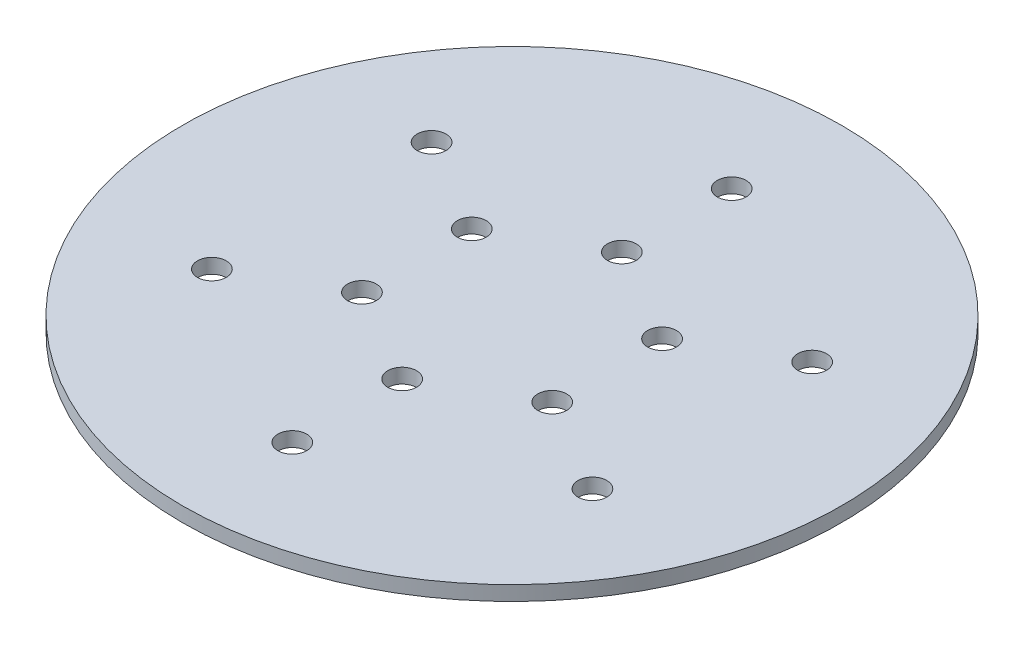
ISO-10303-21;
HEADER;
FILE_DESCRIPTION(('STEP AP214'),'2;1');
FILE_NAME('part.step','',(''),(''),'','','');
FILE_SCHEMA(('AUTOMOTIVE_DESIGN { 1 0 10303 214 1 1 1 1 }'));
ENDSEC;
DATA;
#1=APPLICATION_CONTEXT('core data for automotive mechanical design processes');
#2=APPLICATION_PROTOCOL_DEFINITION('international standard','automotive_design',2000,#1);
#3=PRODUCT_CONTEXT('',#1,'mechanical');
#4=PRODUCT('Part','Part','',(#3));
#5=PRODUCT_RELATED_PRODUCT_CATEGORY('part','',(#4));
#6=PRODUCT_DEFINITION_FORMATION('','',#4);
#7=PRODUCT_DEFINITION_CONTEXT('part definition',#1,'design');
#8=PRODUCT_DEFINITION('design','',#6,#7);
#9=PRODUCT_DEFINITION_SHAPE('','',#8);
#10=(LENGTH_UNIT() NAMED_UNIT(*) SI_UNIT(.MILLI.,.METRE.));
#11=(NAMED_UNIT(*) PLANE_ANGLE_UNIT() SI_UNIT($,.RADIAN.));
#12=(NAMED_UNIT(*) SI_UNIT($,.STERADIAN.) SOLID_ANGLE_UNIT());
#13=UNCERTAINTY_MEASURE_WITH_UNIT(LENGTH_MEASURE(1.E-05),#10,'distance_accuracy_value','');
#14=(GEOMETRIC_REPRESENTATION_CONTEXT(3) GLOBAL_UNCERTAINTY_ASSIGNED_CONTEXT((#13)) GLOBAL_UNIT_ASSIGNED_CONTEXT((#10,
#11,#12)) REPRESENTATION_CONTEXT('',''));
#15=CARTESIAN_POINT('',(0.,0.,0.));
#16=DIRECTION('',(0.,0.,1.));
#17=DIRECTION('',(1.,0.,0.));
#18=AXIS2_PLACEMENT_3D('',#15,#16,#17);
#19=CARTESIAN_POINT('',(0.,5.08,0.));
#20=DIRECTION('',(0.,1.,0.));
#21=DIRECTION('',(0.,0.,1.));
#22=AXIS2_PLACEMENT_3D('',#19,#20,#21);
#23=PLANE('',#22);
#24=CARTESIAN_POINT('',(-32.9955678841852,5.08,-19.0499999999967));
#25=DIRECTION('',(0.,1.,0.));
#26=DIRECTION('',(0.,0.,1.));
#27=AXIS2_PLACEMENT_3D('',#24,#25,#26);
#28=CIRCLE('',#27,5.);
#29=CARTESIAN_POINT('',(-32.9955678841852,5.08,-14.0499999999967));
#30=VERTEX_POINT('',#29);
#31=EDGE_CURVE('E101',#30,#30,#28,.T.);
#32=ORIENTED_EDGE('',*,*,#31,.F.);
#33=EDGE_LOOP('',(#32));
#34=FACE_BOUND('',#33,.T.);
#35=CARTESIAN_POINT('',(-32.9955678841814,5.08,19.0500000000033));
#36=DIRECTION('',(0.,1.,0.));
#37=DIRECTION('',(0.,0.,1.));
#38=AXIS2_PLACEMENT_3D('',#35,#36,#37);
#39=CIRCLE('',#38,5.);
#40=CARTESIAN_POINT('',(-32.9955678841814,5.08,24.0500000000033));
#41=VERTEX_POINT('',#40);
#42=EDGE_CURVE('E89',#41,#41,#39,.T.);
#43=ORIENTED_EDGE('',*,*,#42,.F.);
#44=EDGE_LOOP('',(#43));
#45=FACE_BOUND('',#44,.T.);
#46=CARTESIAN_POINT('',(7.57073809647924E-12,5.08,38.1));
#47=DIRECTION('',(0.,1.,0.));
#48=DIRECTION('',(0.,0.,1.));
#49=AXIS2_PLACEMENT_3D('',#46,#47,#48);
#50=CIRCLE('',#49,5.);
#51=CARTESIAN_POINT('',(7.57073809647924E-12,5.08,43.1));
#52=VERTEX_POINT('',#51);
#53=EDGE_CURVE('E77',#52,#52,#50,.T.);
#54=ORIENTED_EDGE('',*,*,#53,.F.);
#55=EDGE_LOOP('',(#54));
#56=FACE_BOUND('',#55,.T.);
#57=CARTESIAN_POINT('',(32.9955678841928,5.08,19.0499999999967));
#58=DIRECTION('',(0.,1.,0.));
#59=DIRECTION('',(0.,0.,1.));
#60=AXIS2_PLACEMENT_3D('',#57,#58,#59);
#61=CIRCLE('',#60,5.);
#62=CARTESIAN_POINT('',(32.9955678841928,5.08,24.0499999999967));
#63=VERTEX_POINT('',#62);
#64=EDGE_CURVE('E65',#63,#63,#61,.T.);
#65=ORIENTED_EDGE('',*,*,#64,.F.);
#66=EDGE_LOOP('',(#65));
#67=FACE_BOUND('',#66,.T.);
#68=CARTESIAN_POINT('',(32.995567884189,5.08,-19.0500000000033));
#69=DIRECTION('',(0.,1.,0.));
#70=DIRECTION('',(0.,0.,1.));
#71=AXIS2_PLACEMENT_3D('',#68,#69,#70);
#72=CIRCLE('',#71,5.);
#73=CARTESIAN_POINT('',(32.995567884189,5.08,-14.0500000000033));
#74=VERTEX_POINT('',#73);
#75=EDGE_CURVE('E53',#74,#74,#72,.T.);
#76=ORIENTED_EDGE('',*,*,#75,.F.);
#77=EDGE_LOOP('',(#76));
#78=FACE_BOUND('',#77,.T.);
#79=CARTESIAN_POINT('',(0.,5.08,-38.1));
#80=DIRECTION('',(0.,1.,0.));
#81=DIRECTION('',(0.,0.,1.));
#82=AXIS2_PLACEMENT_3D('',#79,#80,#81);
#83=CIRCLE('',#82,5.);
#84=CARTESIAN_POINT('',(0.,5.08,-33.1));
#85=VERTEX_POINT('',#84);
#86=EDGE_CURVE('E42',#85,#85,#83,.T.);
#87=ORIENTED_EDGE('',*,*,#86,.F.);
#88=EDGE_LOOP('',(#87));
#89=FACE_BOUND('',#88,.T.);
#90=CARTESIAN_POINT('',(0.,5.08,0.));
#91=DIRECTION('',(0.,1.,0.));
#92=DIRECTION('',(0.,0.,1.));
#93=AXIS2_PLACEMENT_3D('',#90,#91,#92);
#94=CIRCLE('',#93,114.3);
#95=CARTESIAN_POINT('',(0.,5.08,114.3));
#96=VERTEX_POINT('',#95);
#97=EDGE_CURVE('E10',#96,#96,#94,.T.);
#98=ORIENTED_EDGE('',*,*,#97,.T.);
#99=EDGE_LOOP('',(#98));
#100=FACE_BOUND('',#99,.T.);
#101=CARTESIAN_POINT('',(0.,5.08,-76.2));
#102=DIRECTION('',(0.,1.,0.));
#103=DIRECTION('',(0.,0.,1.));
#104=AXIS2_PLACEMENT_3D('',#101,#102,#103);
#105=CIRCLE('',#104,5.);
#106=CARTESIAN_POINT('',(0.,5.08,-71.2));
#107=VERTEX_POINT('',#106);
#108=EDGE_CURVE('E47',#107,#107,#105,.T.);
#109=ORIENTED_EDGE('',*,*,#108,.F.);
#110=EDGE_LOOP('',(#109));
#111=FACE_BOUND('',#110,.T.);
#112=CARTESIAN_POINT('',(65.9911357683761,5.08,-38.1000000000033));
#113=DIRECTION('',(0.,1.,0.));
#114=DIRECTION('',(0.,0.,1.));
#115=AXIS2_PLACEMENT_3D('',#112,#113,#114);
#116=CIRCLE('',#115,5.00000000000001);
#117=CARTESIAN_POINT('',(65.9911357683761,5.08,-33.1000000000033));
#118=VERTEX_POINT('',#117);
#119=EDGE_CURVE('E59',#118,#118,#116,.T.);
#120=ORIENTED_EDGE('',*,*,#119,.F.);
#121=EDGE_LOOP('',(#120));
#122=FACE_BOUND('',#121,.T.);
#123=CARTESIAN_POINT('',(65.9911357683799,5.08,38.0999999999967));
#124=DIRECTION('',(0.,1.,0.));
#125=DIRECTION('',(0.,0.,1.));
#126=AXIS2_PLACEMENT_3D('',#123,#124,#125);
#127=CIRCLE('',#126,5.00000000000001);
#128=CARTESIAN_POINT('',(65.9911357683799,5.08,43.0999999999967));
#129=VERTEX_POINT('',#128);
#130=EDGE_CURVE('E71',#129,#129,#127,.T.);
#131=ORIENTED_EDGE('',*,*,#130,.F.);
#132=EDGE_LOOP('',(#131));
#133=FACE_BOUND('',#132,.T.);
#134=CARTESIAN_POINT('',(7.58940171369825E-12,5.08,76.2));
#135=DIRECTION('',(0.,1.,0.));
#136=DIRECTION('',(0.,0.,1.));
#137=AXIS2_PLACEMENT_3D('',#134,#135,#136);
#138=CIRCLE('',#137,5.);
#139=CARTESIAN_POINT('',(7.58940171369825E-12,5.08,81.2));
#140=VERTEX_POINT('',#139);
#141=EDGE_CURVE('E83',#140,#140,#138,.T.);
#142=ORIENTED_EDGE('',*,*,#141,.F.);
#143=EDGE_LOOP('',(#142));
#144=FACE_BOUND('',#143,.T.);
#145=CARTESIAN_POINT('',(-65.9911357683685,5.08,38.1000000000033));
#146=DIRECTION('',(0.,1.,0.));
#147=DIRECTION('',(0.,0.,1.));
#148=AXIS2_PLACEMENT_3D('',#145,#146,#147);
#149=CIRCLE('',#148,5.);
#150=CARTESIAN_POINT('',(-65.9911357683685,5.08,43.1000000000033));
#151=VERTEX_POINT('',#150);
#152=EDGE_CURVE('E95',#151,#151,#149,.T.);
#153=ORIENTED_EDGE('',*,*,#152,.F.);
#154=EDGE_LOOP('',(#153));
#155=FACE_BOUND('',#154,.T.);
#156=CARTESIAN_POINT('',(-65.9911357683724,5.08,-38.0999999999967));
#157=DIRECTION('',(0.,1.,0.));
#158=DIRECTION('',(0.,0.,1.));
#159=AXIS2_PLACEMENT_3D('',#156,#157,#158);
#160=CIRCLE('',#159,5.);
#161=CARTESIAN_POINT('',(-65.9911357683724,5.08,-33.0999999999967));
#162=VERTEX_POINT('',#161);
#163=EDGE_CURVE('E107',#162,#162,#160,.T.);
#164=ORIENTED_EDGE('',*,*,#163,.F.);
#165=EDGE_LOOP('',(#164));
#166=FACE_BOUND('',#165,.T.);
#167=ADVANCED_FACE('F31',(#34,#45,#56,#67,#78,#89,#100,#111,#122,#133,#144,#155,#166),#23,.T.);
#168=CARTESIAN_POINT('',(0.,0.,0.));
#169=DIRECTION('',(0.,1.,0.));
#170=DIRECTION('',(0.,0.,1.));
#171=AXIS2_PLACEMENT_3D('',#168,#169,#170);
#172=PLANE('',#171);
#173=CARTESIAN_POINT('',(0.,0.,0.));
#174=DIRECTION('',(0.,1.,0.));
#175=DIRECTION('',(0.,0.,1.));
#176=AXIS2_PLACEMENT_3D('',#173,#174,#175);
#177=CIRCLE('',#176,114.3);
#178=CARTESIAN_POINT('',(0.,0.,114.3));
#179=VERTEX_POINT('',#178);
#180=EDGE_CURVE('E35',#179,#179,#177,.T.);
#181=ORIENTED_EDGE('',*,*,#180,.F.);
#182=EDGE_LOOP('',(#181));
#183=FACE_BOUND('',#182,.T.);
#184=CARTESIAN_POINT('',(0.,0.,-38.1));
#185=DIRECTION('',(0.,1.,0.));
#186=DIRECTION('',(0.,0.,1.));
#187=AXIS2_PLACEMENT_3D('',#184,#185,#186);
#188=CIRCLE('',#187,5.);
#189=CARTESIAN_POINT('',(0.,0.,-33.1));
#190=VERTEX_POINT('',#189);
#191=EDGE_CURVE('E44',#190,#190,#188,.T.);
#192=ORIENTED_EDGE('',*,*,#191,.T.);
#193=EDGE_LOOP('',(#192));
#194=FACE_BOUND('',#193,.T.);
#195=CARTESIAN_POINT('',(0.,0.,-76.2));
#196=DIRECTION('',(0.,1.,0.));
#197=DIRECTION('',(0.,0.,1.));
#198=AXIS2_PLACEMENT_3D('',#195,#196,#197);
#199=CIRCLE('',#198,5.);
#200=CARTESIAN_POINT('',(0.,0.,-71.2));
#201=VERTEX_POINT('',#200);
#202=EDGE_CURVE('E50',#201,#201,#199,.T.);
#203=ORIENTED_EDGE('',*,*,#202,.T.);
#204=EDGE_LOOP('',(#203));
#205=FACE_BOUND('',#204,.T.);
#206=CARTESIAN_POINT('',(32.995567884189,0.,-19.0500000000033));
#207=DIRECTION('',(0.,1.,0.));
#208=DIRECTION('',(0.,0.,1.));
#209=AXIS2_PLACEMENT_3D('',#206,#207,#208);
#210=CIRCLE('',#209,5.);
#211=CARTESIAN_POINT('',(32.995567884189,0.,-14.0500000000033));
#212=VERTEX_POINT('',#211);
#213=EDGE_CURVE('E56',#212,#212,#210,.T.);
#214=ORIENTED_EDGE('',*,*,#213,.T.);
#215=EDGE_LOOP('',(#214));
#216=FACE_BOUND('',#215,.T.);
#217=CARTESIAN_POINT('',(65.9911357683761,0.,-38.1000000000033));
#218=DIRECTION('',(0.,1.,0.));
#219=DIRECTION('',(0.,0.,1.));
#220=AXIS2_PLACEMENT_3D('',#217,#218,#219);
#221=CIRCLE('',#220,5.00000000000001);
#222=CARTESIAN_POINT('',(65.9911357683761,0.,-33.1000000000033));
#223=VERTEX_POINT('',#222);
#224=EDGE_CURVE('E62',#223,#223,#221,.T.);
#225=ORIENTED_EDGE('',*,*,#224,.T.);
#226=EDGE_LOOP('',(#225));
#227=FACE_BOUND('',#226,.T.);
#228=CARTESIAN_POINT('',(32.9955678841928,0.,19.0499999999967));
#229=DIRECTION('',(0.,1.,0.));
#230=DIRECTION('',(0.,0.,1.));
#231=AXIS2_PLACEMENT_3D('',#228,#229,#230);
#232=CIRCLE('',#231,5.);
#233=CARTESIAN_POINT('',(32.9955678841928,0.,24.0499999999967));
#234=VERTEX_POINT('',#233);
#235=EDGE_CURVE('E68',#234,#234,#232,.T.);
#236=ORIENTED_EDGE('',*,*,#235,.T.);
#237=EDGE_LOOP('',(#236));
#238=FACE_BOUND('',#237,.T.);
#239=CARTESIAN_POINT('',(65.9911357683799,0.,38.0999999999967));
#240=DIRECTION('',(0.,1.,0.));
#241=DIRECTION('',(0.,0.,1.));
#242=AXIS2_PLACEMENT_3D('',#239,#240,#241);
#243=CIRCLE('',#242,5.00000000000001);
#244=CARTESIAN_POINT('',(65.9911357683799,0.,43.0999999999967));
#245=VERTEX_POINT('',#244);
#246=EDGE_CURVE('E74',#245,#245,#243,.T.);
#247=ORIENTED_EDGE('',*,*,#246,.T.);
#248=EDGE_LOOP('',(#247));
#249=FACE_BOUND('',#248,.T.);
#250=CARTESIAN_POINT('',(7.57073809647924E-12,0.,38.1));
#251=DIRECTION('',(0.,1.,0.));
#252=DIRECTION('',(0.,0.,1.));
#253=AXIS2_PLACEMENT_3D('',#250,#251,#252);
#254=CIRCLE('',#253,5.);
#255=CARTESIAN_POINT('',(7.57073809647924E-12,0.,43.1));
#256=VERTEX_POINT('',#255);
#257=EDGE_CURVE('E80',#256,#256,#254,.T.);
#258=ORIENTED_EDGE('',*,*,#257,.T.);
#259=EDGE_LOOP('',(#258));
#260=FACE_BOUND('',#259,.T.);
#261=CARTESIAN_POINT('',(7.58940171369825E-12,0.,76.2));
#262=DIRECTION('',(0.,1.,0.));
#263=DIRECTION('',(0.,0.,1.));
#264=AXIS2_PLACEMENT_3D('',#261,#262,#263);
#265=CIRCLE('',#264,5.);
#266=CARTESIAN_POINT('',(7.58940171369825E-12,0.,81.2));
#267=VERTEX_POINT('',#266);
#268=EDGE_CURVE('E86',#267,#267,#265,.T.);
#269=ORIENTED_EDGE('',*,*,#268,.T.);
#270=EDGE_LOOP('',(#269));
#271=FACE_BOUND('',#270,.T.);
#272=CARTESIAN_POINT('',(-32.9955678841814,0.,19.0500000000033));
#273=DIRECTION('',(0.,1.,0.));
#274=DIRECTION('',(0.,0.,1.));
#275=AXIS2_PLACEMENT_3D('',#272,#273,#274);
#276=CIRCLE('',#275,5.);
#277=CARTESIAN_POINT('',(-32.9955678841814,0.,24.0500000000033));
#278=VERTEX_POINT('',#277);
#279=EDGE_CURVE('E92',#278,#278,#276,.T.);
#280=ORIENTED_EDGE('',*,*,#279,.T.);
#281=EDGE_LOOP('',(#280));
#282=FACE_BOUND('',#281,.T.);
#283=CARTESIAN_POINT('',(-65.9911357683685,0.,38.1000000000033));
#284=DIRECTION('',(0.,1.,0.));
#285=DIRECTION('',(0.,0.,1.));
#286=AXIS2_PLACEMENT_3D('',#283,#284,#285);
#287=CIRCLE('',#286,5.);
#288=CARTESIAN_POINT('',(-65.9911357683685,0.,43.1000000000033));
#289=VERTEX_POINT('',#288);
#290=EDGE_CURVE('E98',#289,#289,#287,.T.);
#291=ORIENTED_EDGE('',*,*,#290,.T.);
#292=EDGE_LOOP('',(#291));
#293=FACE_BOUND('',#292,.T.);
#294=CARTESIAN_POINT('',(-32.9955678841852,0.,-19.0499999999967));
#295=DIRECTION('',(0.,1.,0.));
#296=DIRECTION('',(0.,0.,1.));
#297=AXIS2_PLACEMENT_3D('',#294,#295,#296);
#298=CIRCLE('',#297,5.);
#299=CARTESIAN_POINT('',(-32.9955678841852,0.,-14.0499999999967));
#300=VERTEX_POINT('',#299);
#301=EDGE_CURVE('E104',#300,#300,#298,.T.);
#302=ORIENTED_EDGE('',*,*,#301,.T.);
#303=EDGE_LOOP('',(#302));
#304=FACE_BOUND('',#303,.T.);
#305=CARTESIAN_POINT('',(-65.9911357683724,0.,-38.0999999999967));
#306=DIRECTION('',(0.,1.,0.));
#307=DIRECTION('',(0.,0.,1.));
#308=AXIS2_PLACEMENT_3D('',#305,#306,#307);
#309=CIRCLE('',#308,5.);
#310=CARTESIAN_POINT('',(-65.9911357683724,0.,-33.0999999999967));
#311=VERTEX_POINT('',#310);
#312=EDGE_CURVE('E110',#311,#311,#309,.T.);
#313=ORIENTED_EDGE('',*,*,#312,.T.);
#314=EDGE_LOOP('',(#313));
#315=FACE_BOUND('',#314,.T.);
#316=ADVANCED_FACE('F120',(#183,#194,#205,#216,#227,#238,#249,#260,#271,#282,#293,#304,#315),
#172,.F.);
#317=CARTESIAN_POINT('',(0.,5.08,0.));
#318=DIRECTION('',(0.,-1.,0.));
#319=DIRECTION('',(0.,0.,-1.));
#320=AXIS2_PLACEMENT_3D('',#317,#318,#319);
#321=CYLINDRICAL_SURFACE('',#320,114.3);
#322=ORIENTED_EDGE('',*,*,#97,.F.);
#323=EDGE_LOOP('',(#322));
#324=FACE_BOUND('',#323,.T.);
#325=ORIENTED_EDGE('',*,*,#180,.T.);
#326=EDGE_LOOP('',(#325));
#327=FACE_BOUND('',#326,.T.);
#328=ADVANCED_FACE('F33',(#324,#327),#321,.T.);
#329=CARTESIAN_POINT('',(0.,5.08,-38.1));
#330=DIRECTION('',(0.,-1.,0.));
#331=DIRECTION('',(0.,0.,-1.));
#332=AXIS2_PLACEMENT_3D('',#329,#330,#331);
#333=CYLINDRICAL_SURFACE('',#332,5.);
#334=ORIENTED_EDGE('',*,*,#86,.T.);
#335=EDGE_LOOP('',(#334));
#336=FACE_BOUND('',#335,.T.);
#337=ORIENTED_EDGE('',*,*,#191,.F.);
#338=EDGE_LOOP('',(#337));
#339=FACE_BOUND('',#338,.T.);
#340=ADVANCED_FACE('F130',(#336,#339),#333,.F.);
#341=CARTESIAN_POINT('',(0.,5.08,-76.2));
#342=DIRECTION('',(0.,-1.,0.));
#343=DIRECTION('',(0.,0.,-1.));
#344=AXIS2_PLACEMENT_3D('',#341,#342,#343);
#345=CYLINDRICAL_SURFACE('',#344,5.);
#346=ORIENTED_EDGE('',*,*,#108,.T.);
#347=EDGE_LOOP('',(#346));
#348=FACE_BOUND('',#347,.T.);
#349=ORIENTED_EDGE('',*,*,#202,.F.);
#350=EDGE_LOOP('',(#349));
#351=FACE_BOUND('',#350,.T.);
#352=ADVANCED_FACE('F133',(#348,#351),#345,.F.);
#353=CARTESIAN_POINT('',(32.995567884189,5.08,-19.0500000000033));
#354=DIRECTION('',(0.,-1.,0.));
#355=DIRECTION('',(0.,0.,-1.));
#356=AXIS2_PLACEMENT_3D('',#353,#354,#355);
#357=CYLINDRICAL_SURFACE('',#356,5.);
#358=ORIENTED_EDGE('',*,*,#75,.T.);
#359=EDGE_LOOP('',(#358));
#360=FACE_BOUND('',#359,.T.);
#361=ORIENTED_EDGE('',*,*,#213,.F.);
#362=EDGE_LOOP('',(#361));
#363=FACE_BOUND('',#362,.T.);
#364=ADVANCED_FACE('F137',(#360,#363),#357,.F.);
#365=CARTESIAN_POINT('',(65.9911357683761,5.08,-38.1000000000033));
#366=DIRECTION('',(0.,-1.,0.));
#367=DIRECTION('',(0.,0.,-1.));
#368=AXIS2_PLACEMENT_3D('',#365,#366,#367);
#369=CYLINDRICAL_SURFACE('',#368,5.00000000000001);
#370=ORIENTED_EDGE('',*,*,#119,.T.);
#371=EDGE_LOOP('',(#370));
#372=FACE_BOUND('',#371,.T.);
#373=ORIENTED_EDGE('',*,*,#224,.F.);
#374=EDGE_LOOP('',(#373));
#375=FACE_BOUND('',#374,.T.);
#376=ADVANCED_FACE('F141',(#372,#375),#369,.F.);
#377=CARTESIAN_POINT('',(32.9955678841928,5.08,19.0499999999967));
#378=DIRECTION('',(0.,-1.,0.));
#379=DIRECTION('',(0.,0.,-1.));
#380=AXIS2_PLACEMENT_3D('',#377,#378,#379);
#381=CYLINDRICAL_SURFACE('',#380,5.);
#382=ORIENTED_EDGE('',*,*,#64,.T.);
#383=EDGE_LOOP('',(#382));
#384=FACE_BOUND('',#383,.T.);
#385=ORIENTED_EDGE('',*,*,#235,.F.);
#386=EDGE_LOOP('',(#385));
#387=FACE_BOUND('',#386,.T.);
#388=ADVANCED_FACE('F145',(#384,#387),#381,.F.);
#389=CARTESIAN_POINT('',(65.9911357683799,5.08,38.0999999999967));
#390=DIRECTION('',(0.,-1.,0.));
#391=DIRECTION('',(0.,0.,-1.));
#392=AXIS2_PLACEMENT_3D('',#389,#390,#391);
#393=CYLINDRICAL_SURFACE('',#392,5.00000000000001);
#394=ORIENTED_EDGE('',*,*,#130,.T.);
#395=EDGE_LOOP('',(#394));
#396=FACE_BOUND('',#395,.T.);
#397=ORIENTED_EDGE('',*,*,#246,.F.);
#398=EDGE_LOOP('',(#397));
#399=FACE_BOUND('',#398,.T.);
#400=ADVANCED_FACE('F149',(#396,#399),#393,.F.);
#401=CARTESIAN_POINT('',(7.57073809647924E-12,5.08,38.1));
#402=DIRECTION('',(0.,-1.,0.));
#403=DIRECTION('',(0.,0.,-1.));
#404=AXIS2_PLACEMENT_3D('',#401,#402,#403);
#405=CYLINDRICAL_SURFACE('',#404,5.);
#406=ORIENTED_EDGE('',*,*,#53,.T.);
#407=EDGE_LOOP('',(#406));
#408=FACE_BOUND('',#407,.T.);
#409=ORIENTED_EDGE('',*,*,#257,.F.);
#410=EDGE_LOOP('',(#409));
#411=FACE_BOUND('',#410,.T.);
#412=ADVANCED_FACE('F153',(#408,#411),#405,.F.);
#413=CARTESIAN_POINT('',(7.58940171369825E-12,5.08,76.2));
#414=DIRECTION('',(0.,-1.,0.));
#415=DIRECTION('',(0.,0.,-1.));
#416=AXIS2_PLACEMENT_3D('',#413,#414,#415);
#417=CYLINDRICAL_SURFACE('',#416,5.);
#418=ORIENTED_EDGE('',*,*,#141,.T.);
#419=EDGE_LOOP('',(#418));
#420=FACE_BOUND('',#419,.T.);
#421=ORIENTED_EDGE('',*,*,#268,.F.);
#422=EDGE_LOOP('',(#421));
#423=FACE_BOUND('',#422,.T.);
#424=ADVANCED_FACE('F157',(#420,#423),#417,.F.);
#425=CARTESIAN_POINT('',(-32.9955678841814,5.08,19.0500000000033));
#426=DIRECTION('',(0.,-1.,0.));
#427=DIRECTION('',(0.,0.,-1.));
#428=AXIS2_PLACEMENT_3D('',#425,#426,#427);
#429=CYLINDRICAL_SURFACE('',#428,5.);
#430=ORIENTED_EDGE('',*,*,#42,.T.);
#431=EDGE_LOOP('',(#430));
#432=FACE_BOUND('',#431,.T.);
#433=ORIENTED_EDGE('',*,*,#279,.F.);
#434=EDGE_LOOP('',(#433));
#435=FACE_BOUND('',#434,.T.);
#436=ADVANCED_FACE('F161',(#432,#435),#429,.F.);
#437=CARTESIAN_POINT('',(-65.9911357683685,5.08,38.1000000000033));
#438=DIRECTION('',(0.,-1.,0.));
#439=DIRECTION('',(0.,0.,-1.));
#440=AXIS2_PLACEMENT_3D('',#437,#438,#439);
#441=CYLINDRICAL_SURFACE('',#440,5.);
#442=ORIENTED_EDGE('',*,*,#152,.T.);
#443=EDGE_LOOP('',(#442));
#444=FACE_BOUND('',#443,.T.);
#445=ORIENTED_EDGE('',*,*,#290,.F.);
#446=EDGE_LOOP('',(#445));
#447=FACE_BOUND('',#446,.T.);
#448=ADVANCED_FACE('F165',(#444,#447),#441,.F.);
#449=CARTESIAN_POINT('',(-32.9955678841852,5.08,-19.0499999999967));
#450=DIRECTION('',(0.,-1.,0.));
#451=DIRECTION('',(0.,0.,-1.));
#452=AXIS2_PLACEMENT_3D('',#449,#450,#451);
#453=CYLINDRICAL_SURFACE('',#452,5.);
#454=ORIENTED_EDGE('',*,*,#31,.T.);
#455=EDGE_LOOP('',(#454));
#456=FACE_BOUND('',#455,.T.);
#457=ORIENTED_EDGE('',*,*,#301,.F.);
#458=EDGE_LOOP('',(#457));
#459=FACE_BOUND('',#458,.T.);
#460=ADVANCED_FACE('F169',(#456,#459),#453,.F.);
#461=CARTESIAN_POINT('',(-65.9911357683724,5.08,-38.0999999999967));
#462=DIRECTION('',(0.,-1.,0.));
#463=DIRECTION('',(0.,0.,-1.));
#464=AXIS2_PLACEMENT_3D('',#461,#462,#463);
#465=CYLINDRICAL_SURFACE('',#464,5.);
#466=ORIENTED_EDGE('',*,*,#163,.T.);
#467=EDGE_LOOP('',(#466));
#468=FACE_BOUND('',#467,.T.);
#469=ORIENTED_EDGE('',*,*,#312,.F.);
#470=EDGE_LOOP('',(#469));
#471=FACE_BOUND('',#470,.T.);
#472=ADVANCED_FACE('F116',(#468,#471),#465,.F.);
#473=CLOSED_SHELL('',(#167,#316,#328,#340,#352,#364,#376,#388,#400,#412,#424,#436,#448,#460,#472));
#474=MANIFOLD_SOLID_BREP('B2',#473);
#475=ADVANCED_BREP_SHAPE_REPRESENTATION('',(#18,#474),#14);
#476=SHAPE_DEFINITION_REPRESENTATION(#9,#475);
ENDSEC;
END-ISO-10303-21;
